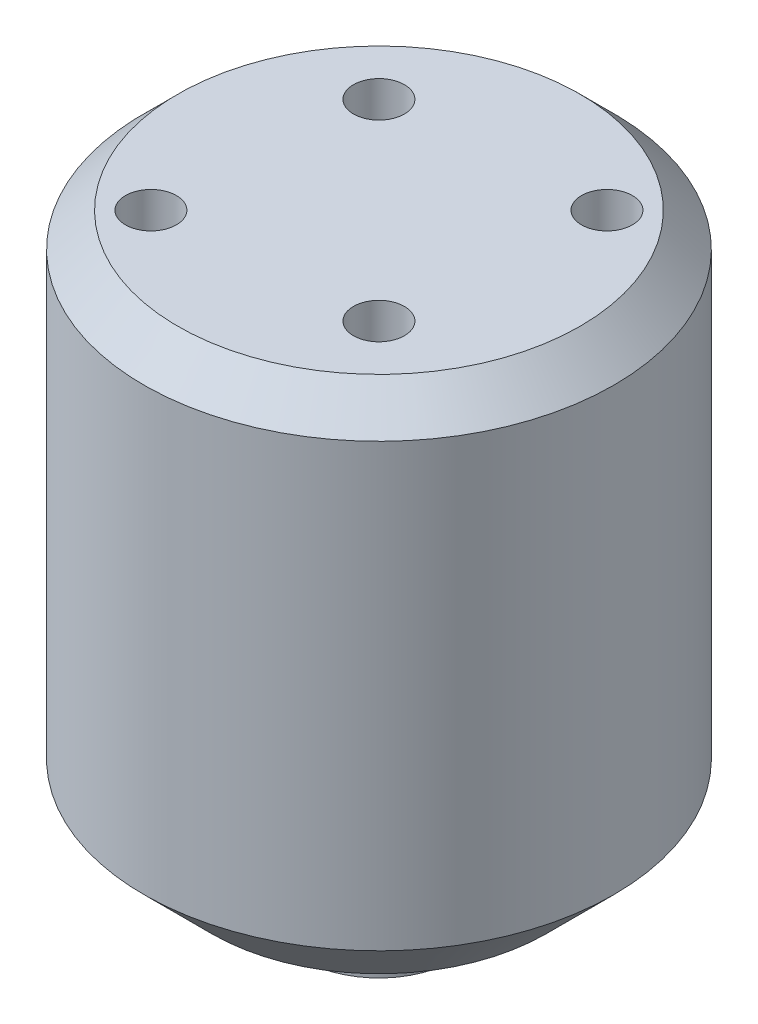
ISO-10303-21;
HEADER;
FILE_DESCRIPTION(('STEP AP214'),'2;1');
FILE_NAME('part.step','',(''),(''),'','','');
FILE_SCHEMA(('AUTOMOTIVE_DESIGN { 1 0 10303 214 1 1 1 1 }'));
ENDSEC;
DATA;
#1=APPLICATION_CONTEXT('core data for automotive mechanical design processes');
#2=APPLICATION_PROTOCOL_DEFINITION('international standard','automotive_design',2000,#1);
#3=PRODUCT_CONTEXT('',#1,'mechanical');
#4=PRODUCT('Part','Part','',(#3));
#5=PRODUCT_RELATED_PRODUCT_CATEGORY('part','',(#4));
#6=PRODUCT_DEFINITION_FORMATION('','',#4);
#7=PRODUCT_DEFINITION_CONTEXT('part definition',#1,'design');
#8=PRODUCT_DEFINITION('design','',#6,#7);
#9=PRODUCT_DEFINITION_SHAPE('','',#8);
#10=(LENGTH_UNIT() NAMED_UNIT(*) SI_UNIT(.MILLI.,.METRE.));
#11=(NAMED_UNIT(*) PLANE_ANGLE_UNIT() SI_UNIT($,.RADIAN.));
#12=(NAMED_UNIT(*) SI_UNIT($,.STERADIAN.) SOLID_ANGLE_UNIT());
#13=UNCERTAINTY_MEASURE_WITH_UNIT(LENGTH_MEASURE(1.E-05),#10,'distance_accuracy_value','');
#14=(GEOMETRIC_REPRESENTATION_CONTEXT(3) GLOBAL_UNCERTAINTY_ASSIGNED_CONTEXT((#13)) GLOBAL_UNIT_ASSIGNED_CONTEXT((#10,
#11,#12)) REPRESENTATION_CONTEXT('',''));
#15=CARTESIAN_POINT('',(0.,0.,0.));
#16=DIRECTION('',(0.,0.,1.));
#17=DIRECTION('',(1.,0.,0.));
#18=AXIS2_PLACEMENT_3D('',#15,#16,#17);
#19=CARTESIAN_POINT('',(0.,-32.,0.));
#20=DIRECTION('',(0.,1.,0.));
#21=DIRECTION('',(-1.,0.,0.));
#22=AXIS2_PLACEMENT_3D('',#19,#20,#21);
#23=CYLINDRICAL_SURFACE('',#22,13.85);
#24=CARTESIAN_POINT('',(0.,-28.,0.));
#25=DIRECTION('',(0.,-1.,0.));
#26=DIRECTION('',(1.,0.,0.));
#27=AXIS2_PLACEMENT_3D('',#24,#25,#26);
#28=CIRCLE('',#27,13.85);
#29=CARTESIAN_POINT('',(13.85,-28.,0.));
#30=VERTEX_POINT('',#29);
#31=EDGE_CURVE('E10',#30,#30,#28,.F.);
#32=ORIENTED_EDGE('',*,*,#31,.T.);
#33=EDGE_LOOP('',(#32));
#34=FACE_BOUND('',#33,.T.);
#35=CARTESIAN_POINT('',(0.,-2.,0.));
#36=DIRECTION('',(0.,-1.,0.));
#37=DIRECTION('',(1.,0.,0.));
#38=AXIS2_PLACEMENT_3D('',#35,#36,#37);
#39=CIRCLE('',#38,13.85);
#40=CARTESIAN_POINT('',(13.85,-2.,0.));
#41=VERTEX_POINT('',#40);
#42=EDGE_CURVE('E43',#41,#41,#39,.T.);
#43=ORIENTED_EDGE('',*,*,#42,.T.);
#44=EDGE_LOOP('',(#43));
#45=FACE_BOUND('',#44,.T.);
#46=ADVANCED_FACE('F15',(#34,#45),#23,.T.);
#47=CARTESIAN_POINT('',(57.1299920355661,-32.,145.406404651177));
#48=DIRECTION('',(0.,-1.,0.));
#49=DIRECTION('',(0.,0.,1.));
#50=AXIS2_PLACEMENT_3D('',#47,#48,#49);
#51=PLANE('',#50);
#52=CARTESIAN_POINT('',(3.01,-32.,-5.21347293078232));
#53=DIRECTION('',(0.,-1.,0.));
#54=DIRECTION('',(1.,0.,0.));
#55=AXIS2_PLACEMENT_3D('',#52,#53,#54);
#56=CIRCLE('',#55,1.);
#57=CARTESIAN_POINT('',(4.01,-32.,-5.21347293078232));
#58=VERTEX_POINT('',#57);
#59=EDGE_CURVE('E99',#58,#58,#56,.T.);
#60=ORIENTED_EDGE('',*,*,#59,.F.);
#61=EDGE_LOOP('',(#60));
#62=FACE_BOUND('',#61,.T.);
#63=CARTESIAN_POINT('',(-6.02,-32.,0.));
#64=DIRECTION('',(0.,-1.,0.));
#65=DIRECTION('',(1.,0.,0.));
#66=AXIS2_PLACEMENT_3D('',#63,#64,#65);
#67=CIRCLE('',#66,1.);
#68=CARTESIAN_POINT('',(-5.02,-32.,0.));
#69=VERTEX_POINT('',#68);
#70=EDGE_CURVE('E92',#69,#69,#67,.T.);
#71=ORIENTED_EDGE('',*,*,#70,.F.);
#72=EDGE_LOOP('',(#71));
#73=FACE_BOUND('',#72,.T.);
#74=CARTESIAN_POINT('',(3.01,-32.,5.21347293078232));
#75=DIRECTION('',(0.,-1.,0.));
#76=DIRECTION('',(1.,0.,0.));
#77=AXIS2_PLACEMENT_3D('',#74,#75,#76);
#78=CIRCLE('',#77,1.);
#79=CARTESIAN_POINT('',(4.01,-32.,5.21347293078232));
#80=VERTEX_POINT('',#79);
#81=EDGE_CURVE('E84',#80,#80,#78,.T.);
#82=ORIENTED_EDGE('',*,*,#81,.F.);
#83=EDGE_LOOP('',(#82));
#84=FACE_BOUND('',#83,.T.);
#85=CARTESIAN_POINT('',(0.,-32.,0.));
#86=DIRECTION('',(0.,-1.,0.));
#87=DIRECTION('',(1.,0.,0.));
#88=AXIS2_PLACEMENT_3D('',#85,#86,#87);
#89=CIRCLE('',#88,9.85);
#90=CARTESIAN_POINT('',(9.85,-32.,0.));
#91=VERTEX_POINT('',#90);
#92=EDGE_CURVE('E23',#91,#91,#89,.T.);
#93=ORIENTED_EDGE('',*,*,#92,.T.);
#94=EDGE_LOOP('',(#93));
#95=FACE_BOUND('',#94,.T.);
#96=CARTESIAN_POINT('',(0.,-32.,0.));
#97=DIRECTION('',(0.,-1.,0.));
#98=DIRECTION('',(1.,0.,0.));
#99=AXIS2_PLACEMENT_3D('',#96,#97,#98);
#100=CIRCLE('',#99,4.5);
#101=CARTESIAN_POINT('',(4.5,-32.,0.));
#102=VERTEX_POINT('',#101);
#103=EDGE_CURVE('E31',#102,#102,#100,.T.);
#104=ORIENTED_EDGE('',*,*,#103,.F.);
#105=EDGE_LOOP('',(#104));
#106=FACE_BOUND('',#105,.T.);
#107=ADVANCED_FACE('F117',(#62,#73,#84,#95,#106),#51,.T.);
#108=CARTESIAN_POINT('',(57.1299920355661,0.,145.406404651177));
#109=DIRECTION('',(0.,-1.,0.));
#110=DIRECTION('',(0.,0.,1.));
#111=AXIS2_PLACEMENT_3D('',#108,#109,#110);
#112=PLANE('',#111);
#113=CARTESIAN_POINT('',(0.,0.,0.));
#114=DIRECTION('',(0.,-1.,0.));
#115=DIRECTION('',(1.,0.,0.));
#116=AXIS2_PLACEMENT_3D('',#113,#114,#115);
#117=CIRCLE('',#116,11.85);
#118=CARTESIAN_POINT('',(11.85,0.,0.));
#119=VERTEX_POINT('',#118);
#120=EDGE_CURVE('E37',#119,#119,#117,.F.);
#121=ORIENTED_EDGE('',*,*,#120,.T.);
#122=EDGE_LOOP('',(#121));
#123=FACE_BOUND('',#122,.T.);
#124=CARTESIAN_POINT('',(-6.7175144212722,0.,6.7175144212722));
#125=DIRECTION('',(0.,-1.,0.));
#126=DIRECTION('',(1.,0.,0.));
#127=AXIS2_PLACEMENT_3D('',#124,#125,#126);
#128=CIRCLE('',#127,1.5);
#129=CARTESIAN_POINT('',(-5.2175144212722,0.,6.7175144212722));
#130=VERTEX_POINT('',#129);
#131=EDGE_CURVE('E56',#130,#130,#128,.T.);
#132=ORIENTED_EDGE('',*,*,#131,.T.);
#133=EDGE_LOOP('',(#132));
#134=FACE_BOUND('',#133,.T.);
#135=CARTESIAN_POINT('',(6.7175144212722,0.,-6.7175144212722));
#136=DIRECTION('',(0.,-1.,0.));
#137=DIRECTION('',(1.,0.,0.));
#138=AXIS2_PLACEMENT_3D('',#135,#136,#137);
#139=CIRCLE('',#138,1.5);
#140=CARTESIAN_POINT('',(8.2175144212722,0.,-6.7175144212722));
#141=VERTEX_POINT('',#140);
#142=EDGE_CURVE('E65',#141,#141,#139,.T.);
#143=ORIENTED_EDGE('',*,*,#142,.T.);
#144=EDGE_LOOP('',(#143));
#145=FACE_BOUND('',#144,.T.);
#146=CARTESIAN_POINT('',(5.65685424949238,0.,5.65685424949238));
#147=DIRECTION('',(0.,-1.,0.));
#148=DIRECTION('',(1.,0.,0.));
#149=AXIS2_PLACEMENT_3D('',#146,#147,#148);
#150=CIRCLE('',#149,1.5);
#151=CARTESIAN_POINT('',(7.15685424949238,0.,5.65685424949238));
#152=VERTEX_POINT('',#151);
#153=EDGE_CURVE('E73',#152,#152,#150,.T.);
#154=ORIENTED_EDGE('',*,*,#153,.T.);
#155=EDGE_LOOP('',(#154));
#156=FACE_BOUND('',#155,.T.);
#157=CARTESIAN_POINT('',(-5.65685424949238,0.,-5.65685424949239));
#158=DIRECTION('',(0.,-1.,0.));
#159=DIRECTION('',(1.,0.,0.));
#160=AXIS2_PLACEMENT_3D('',#157,#158,#159);
#161=CIRCLE('',#160,1.5);
#162=CARTESIAN_POINT('',(-4.15685424949238,0.,-5.65685424949239));
#163=VERTEX_POINT('',#162);
#164=EDGE_CURVE('E48',#163,#163,#161,.T.);
#165=ORIENTED_EDGE('',*,*,#164,.T.);
#166=EDGE_LOOP('',(#165));
#167=FACE_BOUND('',#166,.T.);
#168=ADVANCED_FACE('F120',(#123,#134,#145,#156,#167),#112,.F.);
#169=CARTESIAN_POINT('',(-5.65685424949238,-8.,-5.65685424949239));
#170=DIRECTION('',(0.,1.,0.));
#171=DIRECTION('',(-1.,0.,0.));
#172=AXIS2_PLACEMENT_3D('',#169,#170,#171);
#173=CYLINDRICAL_SURFACE('',#172,1.5);
#174=CARTESIAN_POINT('',(-5.65685424949238,-8.,-5.65685424949239));
#175=DIRECTION('',(0.,-1.,0.));
#176=DIRECTION('',(1.,0.,0.));
#177=AXIS2_PLACEMENT_3D('',#174,#175,#176);
#178=CIRCLE('',#177,1.5);
#179=CARTESIAN_POINT('',(-4.15685424949238,-8.,-5.65685424949239));
#180=VERTEX_POINT('',#179);
#181=EDGE_CURVE('E47',#180,#180,#178,.T.);
#182=ORIENTED_EDGE('',*,*,#181,.T.);
#183=EDGE_LOOP('',(#182));
#184=FACE_BOUND('',#183,.T.);
#185=ORIENTED_EDGE('',*,*,#164,.F.);
#186=EDGE_LOOP('',(#185));
#187=FACE_BOUND('',#186,.T.);
#188=ADVANCED_FACE('F152',(#184,#187),#173,.F.);
#189=CARTESIAN_POINT('',(57.1299920355661,-8.,145.406404651177));
#190=DIRECTION('',(0.,-1.,0.));
#191=DIRECTION('',(0.,0.,1.));
#192=AXIS2_PLACEMENT_3D('',#189,#190,#191);
#193=PLANE('',#192);
#194=ORIENTED_EDGE('',*,*,#181,.F.);
#195=EDGE_LOOP('',(#194));
#196=FACE_BOUND('',#195,.T.);
#197=ADVANCED_FACE('F157',(#196),#193,.F.);
#198=CARTESIAN_POINT('',(5.65685424949238,-8.,5.65685424949238));
#199=DIRECTION('',(0.,1.,0.));
#200=DIRECTION('',(-1.,0.,0.));
#201=AXIS2_PLACEMENT_3D('',#198,#199,#200);
#202=CYLINDRICAL_SURFACE('',#201,1.5);
#203=CARTESIAN_POINT('',(5.65685424949238,-8.,5.65685424949238));
#204=DIRECTION('',(0.,-1.,0.));
#205=DIRECTION('',(1.,0.,0.));
#206=AXIS2_PLACEMENT_3D('',#203,#204,#205);
#207=CIRCLE('',#206,1.5);
#208=CARTESIAN_POINT('',(7.15685424949238,-8.,5.65685424949238));
#209=VERTEX_POINT('',#208);
#210=EDGE_CURVE('E52',#209,#209,#207,.T.);
#211=ORIENTED_EDGE('',*,*,#210,.T.);
#212=EDGE_LOOP('',(#211));
#213=FACE_BOUND('',#212,.T.);
#214=ORIENTED_EDGE('',*,*,#153,.F.);
#215=EDGE_LOOP('',(#214));
#216=FACE_BOUND('',#215,.T.);
#217=ADVANCED_FACE('F161',(#213,#216),#202,.F.);
#218=CARTESIAN_POINT('',(57.1299920355661,-8.,145.406404651177));
#219=DIRECTION('',(0.,-1.,0.));
#220=DIRECTION('',(0.,0.,1.));
#221=AXIS2_PLACEMENT_3D('',#218,#219,#220);
#222=PLANE('',#221);
#223=ORIENTED_EDGE('',*,*,#210,.F.);
#224=EDGE_LOOP('',(#223));
#225=FACE_BOUND('',#224,.T.);
#226=ADVANCED_FACE('F174',(#225),#222,.F.);
#227=CARTESIAN_POINT('',(6.7175144212722,-8.,-6.7175144212722));
#228=DIRECTION('',(0.,1.,0.));
#229=DIRECTION('',(-1.,0.,0.));
#230=AXIS2_PLACEMENT_3D('',#227,#228,#229);
#231=CYLINDRICAL_SURFACE('',#230,1.5);
#232=CARTESIAN_POINT('',(6.7175144212722,-8.,-6.7175144212722));
#233=DIRECTION('',(0.,-1.,0.));
#234=DIRECTION('',(1.,0.,0.));
#235=AXIS2_PLACEMENT_3D('',#232,#233,#234);
#236=CIRCLE('',#235,1.5);
#237=CARTESIAN_POINT('',(8.2175144212722,-8.,-6.7175144212722));
#238=VERTEX_POINT('',#237);
#239=EDGE_CURVE('E69',#238,#238,#236,.T.);
#240=ORIENTED_EDGE('',*,*,#239,.T.);
#241=EDGE_LOOP('',(#240));
#242=FACE_BOUND('',#241,.T.);
#243=ORIENTED_EDGE('',*,*,#142,.F.);
#244=EDGE_LOOP('',(#243));
#245=FACE_BOUND('',#244,.T.);
#246=ADVANCED_FACE('F171',(#242,#245),#231,.F.);
#247=CARTESIAN_POINT('',(57.1299920355661,-8.,145.406404651177));
#248=DIRECTION('',(0.,-1.,0.));
#249=DIRECTION('',(0.,0.,1.));
#250=AXIS2_PLACEMENT_3D('',#247,#248,#249);
#251=PLANE('',#250);
#252=ORIENTED_EDGE('',*,*,#239,.F.);
#253=EDGE_LOOP('',(#252));
#254=FACE_BOUND('',#253,.T.);
#255=ADVANCED_FACE('F166',(#254),#251,.F.);
#256=CARTESIAN_POINT('',(-6.7175144212722,-8.,6.7175144212722));
#257=DIRECTION('',(0.,1.,0.));
#258=DIRECTION('',(-1.,0.,0.));
#259=AXIS2_PLACEMENT_3D('',#256,#257,#258);
#260=CYLINDRICAL_SURFACE('',#259,1.5);
#261=CARTESIAN_POINT('',(-6.7175144212722,-8.,6.7175144212722));
#262=DIRECTION('',(0.,-1.,0.));
#263=DIRECTION('',(1.,0.,0.));
#264=AXIS2_PLACEMENT_3D('',#261,#262,#263);
#265=CIRCLE('',#264,1.5);
#266=CARTESIAN_POINT('',(-5.2175144212722,-8.,6.7175144212722));
#267=VERTEX_POINT('',#266);
#268=EDGE_CURVE('E60',#267,#267,#265,.T.);
#269=ORIENTED_EDGE('',*,*,#268,.T.);
#270=EDGE_LOOP('',(#269));
#271=FACE_BOUND('',#270,.T.);
#272=ORIENTED_EDGE('',*,*,#131,.F.);
#273=EDGE_LOOP('',(#272));
#274=FACE_BOUND('',#273,.T.);
#275=ADVANCED_FACE('F163',(#271,#274),#260,.F.);
#276=CARTESIAN_POINT('',(57.1299920355661,-8.,145.406404651177));
#277=DIRECTION('',(0.,-1.,0.));
#278=DIRECTION('',(0.,0.,1.));
#279=AXIS2_PLACEMENT_3D('',#276,#277,#278);
#280=PLANE('',#279);
#281=ORIENTED_EDGE('',*,*,#268,.F.);
#282=EDGE_LOOP('',(#281));
#283=FACE_BOUND('',#282,.T.);
#284=ADVANCED_FACE('F141',(#283),#280,.F.);
#285=CARTESIAN_POINT('',(0.,-2.,0.));
#286=DIRECTION('',(0.,-1.,0.));
#287=DIRECTION('',(1.,0.,0.));
#288=AXIS2_PLACEMENT_3D('',#285,#286,#287);
#289=CONICAL_SURFACE('',#288,13.85,0.785398163397448);
#290=ORIENTED_EDGE('',*,*,#120,.F.);
#291=EDGE_LOOP('',(#290));
#292=FACE_BOUND('',#291,.T.);
#293=ORIENTED_EDGE('',*,*,#42,.F.);
#294=EDGE_LOOP('',(#293));
#295=FACE_BOUND('',#294,.T.);
#296=ADVANCED_FACE('F131',(#292,#295),#289,.T.);
#297=CARTESIAN_POINT('',(0.,-36.,0.));
#298=DIRECTION('',(0.,1.,0.));
#299=DIRECTION('',(-1.,0.,0.));
#300=AXIS2_PLACEMENT_3D('',#297,#298,#299);
#301=CYLINDRICAL_SURFACE('',#300,4.5);
#302=CARTESIAN_POINT('',(0.,-36.,0.));
#303=DIRECTION('',(0.,-1.,0.));
#304=DIRECTION('',(1.,0.,0.));
#305=AXIS2_PLACEMENT_3D('',#302,#303,#304);
#306=CIRCLE('',#305,4.5);
#307=CARTESIAN_POINT('',(4.5,-36.,0.));
#308=VERTEX_POINT('',#307);
#309=EDGE_CURVE('E61',#308,#308,#306,.T.);
#310=ORIENTED_EDGE('',*,*,#309,.F.);
#311=EDGE_LOOP('',(#310));
#312=FACE_BOUND('',#311,.T.);
#313=ORIENTED_EDGE('',*,*,#103,.T.);
#314=EDGE_LOOP('',(#313));
#315=FACE_BOUND('',#314,.T.);
#316=ADVANCED_FACE('F128',(#312,#315),#301,.T.);
#317=CARTESIAN_POINT('',(0.,-36.,0.));
#318=DIRECTION('',(0.,-1.,0.));
#319=DIRECTION('',(0.,0.,1.));
#320=AXIS2_PLACEMENT_3D('',#317,#318,#319);
#321=PLANE('',#320);
#322=ORIENTED_EDGE('',*,*,#309,.T.);
#323=EDGE_LOOP('',(#322));
#324=FACE_BOUND('',#323,.T.);
#325=ADVANCED_FACE('F130',(#324),#321,.T.);
#326=CARTESIAN_POINT('',(0.,-32.,0.));
#327=DIRECTION('',(0.,1.,0.));
#328=DIRECTION('',(-1.,0.,0.));
#329=AXIS2_PLACEMENT_3D('',#326,#327,#328);
#330=CONICAL_SURFACE('',#329,9.85,0.785398163397448);
#331=ORIENTED_EDGE('',*,*,#31,.F.);
#332=EDGE_LOOP('',(#331));
#333=FACE_BOUND('',#332,.T.);
#334=ORIENTED_EDGE('',*,*,#92,.F.);
#335=EDGE_LOOP('',(#334));
#336=FACE_BOUND('',#335,.T.);
#337=ADVANCED_FACE('F17',(#333,#336),#330,.T.);
#338=CARTESIAN_POINT('',(3.01,-27.,5.21347293078232));
#339=DIRECTION('',(0.,-1.,0.));
#340=DIRECTION('',(1.,0.,0.));
#341=AXIS2_PLACEMENT_3D('',#338,#339,#340);
#342=CYLINDRICAL_SURFACE('',#341,1.);
#343=CARTESIAN_POINT('',(3.01,-27.,5.21347293078232));
#344=DIRECTION('',(0.,-1.,0.));
#345=DIRECTION('',(1.,0.,0.));
#346=AXIS2_PLACEMENT_3D('',#343,#344,#345);
#347=CIRCLE('',#346,1.);
#348=CARTESIAN_POINT('',(4.01,-27.,5.21347293078232));
#349=VERTEX_POINT('',#348);
#350=EDGE_CURVE('E88',#349,#349,#347,.T.);
#351=ORIENTED_EDGE('',*,*,#350,.F.);
#352=EDGE_LOOP('',(#351));
#353=FACE_BOUND('',#352,.T.);
#354=ORIENTED_EDGE('',*,*,#81,.T.);
#355=EDGE_LOOP('',(#354));
#356=FACE_BOUND('',#355,.T.);
#357=ADVANCED_FACE('F241',(#353,#356),#342,.F.);
#358=CARTESIAN_POINT('',(0.,-27.,0.));
#359=DIRECTION('',(0.,-1.,0.));
#360=DIRECTION('',(0.,0.,1.));
#361=AXIS2_PLACEMENT_3D('',#358,#359,#360);
#362=PLANE('',#361);
#363=ORIENTED_EDGE('',*,*,#350,.T.);
#364=EDGE_LOOP('',(#363));
#365=FACE_BOUND('',#364,.T.);
#366=ADVANCED_FACE('F251',(#365),#362,.T.);
#367=CARTESIAN_POINT('',(-6.02,-27.,0.));
#368=DIRECTION('',(0.,-1.,0.));
#369=DIRECTION('',(1.,0.,0.));
#370=AXIS2_PLACEMENT_3D('',#367,#368,#369);
#371=CYLINDRICAL_SURFACE('',#370,1.);
#372=CARTESIAN_POINT('',(-6.02,-27.,0.));
#373=DIRECTION('',(0.,-1.,0.));
#374=DIRECTION('',(1.,0.,0.));
#375=AXIS2_PLACEMENT_3D('',#372,#373,#374);
#376=CIRCLE('',#375,1.);
#377=CARTESIAN_POINT('',(-5.02,-27.,0.));
#378=VERTEX_POINT('',#377);
#379=EDGE_CURVE('E95',#378,#378,#376,.T.);
#380=ORIENTED_EDGE('',*,*,#379,.F.);
#381=EDGE_LOOP('',(#380));
#382=FACE_BOUND('',#381,.T.);
#383=ORIENTED_EDGE('',*,*,#70,.T.);
#384=EDGE_LOOP('',(#383));
#385=FACE_BOUND('',#384,.T.);
#386=ADVANCED_FACE('F262',(#382,#385),#371,.F.);
#387=CARTESIAN_POINT('',(0.,-27.,0.));
#388=DIRECTION('',(0.,-1.,0.));
#389=DIRECTION('',(0.,0.,1.));
#390=AXIS2_PLACEMENT_3D('',#387,#388,#389);
#391=PLANE('',#390);
#392=ORIENTED_EDGE('',*,*,#379,.T.);
#393=EDGE_LOOP('',(#392));
#394=FACE_BOUND('',#393,.T.);
#395=ADVANCED_FACE('F113',(#394),#391,.T.);
#396=CARTESIAN_POINT('',(3.01,-27.,-5.21347293078232));
#397=DIRECTION('',(0.,-1.,0.));
#398=DIRECTION('',(1.,0.,0.));
#399=AXIS2_PLACEMENT_3D('',#396,#397,#398);
#400=CYLINDRICAL_SURFACE('',#399,1.);
#401=CARTESIAN_POINT('',(3.01,-27.,-5.21347293078232));
#402=DIRECTION('',(0.,-1.,0.));
#403=DIRECTION('',(1.,0.,0.));
#404=AXIS2_PLACEMENT_3D('',#401,#402,#403);
#405=CIRCLE('',#404,1.);
#406=CARTESIAN_POINT('',(4.01,-27.,-5.21347293078232));
#407=VERTEX_POINT('',#406);
#408=EDGE_CURVE('E83',#407,#407,#405,.T.);
#409=ORIENTED_EDGE('',*,*,#408,.F.);
#410=EDGE_LOOP('',(#409));
#411=FACE_BOUND('',#410,.T.);
#412=ORIENTED_EDGE('',*,*,#59,.T.);
#413=EDGE_LOOP('',(#412));
#414=FACE_BOUND('',#413,.T.);
#415=ADVANCED_FACE('F110',(#411,#414),#400,.F.);
#416=CARTESIAN_POINT('',(0.,-27.,0.));
#417=DIRECTION('',(0.,-1.,0.));
#418=DIRECTION('',(0.,0.,1.));
#419=AXIS2_PLACEMENT_3D('',#416,#417,#418);
#420=PLANE('',#419);
#421=ORIENTED_EDGE('',*,*,#408,.T.);
#422=EDGE_LOOP('',(#421));
#423=FACE_BOUND('',#422,.T.);
#424=ADVANCED_FACE('F108',(#423),#420,.T.);
#425=CLOSED_SHELL('',(#46,#107,#168,#188,#197,#217,#226,#246,#255,#275,#284,#296,#316,#325,#337,
#357,#366,#386,#395,#415,#424));
#426=MANIFOLD_SOLID_BREP('B1',#425);
#427=ADVANCED_BREP_SHAPE_REPRESENTATION('',(#18,#426),#14);
#428=SHAPE_DEFINITION_REPRESENTATION(#9,#427);
ENDSEC;
END-ISO-10303-21;
